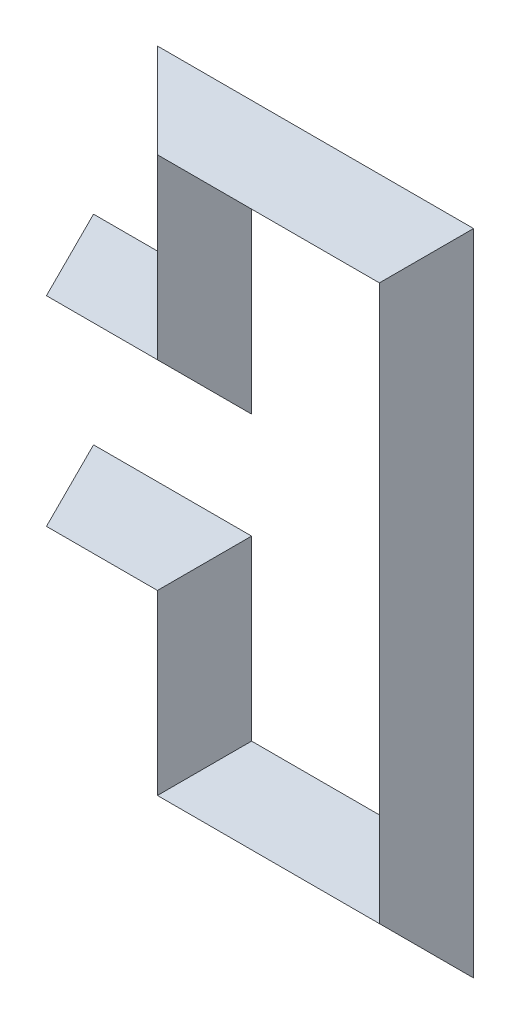
ISO-10303-21;
HEADER;
FILE_DESCRIPTION(('STEP AP214'),'2;1');
FILE_NAME('part.step','',(''),(''),'','','');
FILE_SCHEMA(('AUTOMOTIVE_DESIGN { 1 0 10303 214 1 1 1 1 }'));
ENDSEC;
DATA;
#1=APPLICATION_CONTEXT('core data for automotive mechanical design processes');
#2=APPLICATION_PROTOCOL_DEFINITION('international standard','automotive_design',2000,#1);
#3=PRODUCT_CONTEXT('',#1,'mechanical');
#4=PRODUCT('Part','Part','',(#3));
#5=PRODUCT_RELATED_PRODUCT_CATEGORY('part','',(#4));
#6=PRODUCT_DEFINITION_FORMATION('','',#4);
#7=PRODUCT_DEFINITION_CONTEXT('part definition',#1,'design');
#8=PRODUCT_DEFINITION('design','',#6,#7);
#9=PRODUCT_DEFINITION_SHAPE('','',#8);
#10=(LENGTH_UNIT() NAMED_UNIT(*) SI_UNIT(.MILLI.,.METRE.));
#11=(NAMED_UNIT(*) PLANE_ANGLE_UNIT() SI_UNIT($,.RADIAN.));
#12=(NAMED_UNIT(*) SI_UNIT($,.STERADIAN.) SOLID_ANGLE_UNIT());
#13=UNCERTAINTY_MEASURE_WITH_UNIT(LENGTH_MEASURE(1.E-05),#10,'distance_accuracy_value','');
#14=(GEOMETRIC_REPRESENTATION_CONTEXT(3) GLOBAL_UNCERTAINTY_ASSIGNED_CONTEXT((#13)) GLOBAL_UNIT_ASSIGNED_CONTEXT((#10,
#11,#12)) REPRESENTATION_CONTEXT('',''));
#15=CARTESIAN_POINT('',(0.,0.,0.));
#16=DIRECTION('',(0.,0.,1.));
#17=DIRECTION('',(1.,0.,0.));
#18=AXIS2_PLACEMENT_3D('',#15,#16,#17);
#19=CARTESIAN_POINT('',(90.4003260107554,-49.5996739892445,-19.187122575159));
#20=DIRECTION('',(0.,-0.707106781186547,-0.707106781186548));
#21=DIRECTION('',(0.,0.707106781186548,-0.707106781186547));
#22=AXIS2_PLACEMENT_3D('',#19,#20,#21);
#23=PLANE('',#22);
#24=DIRECTION('',(0.,0.707106781186548,-0.707106781186547));
#25=VECTOR('',#24,1.);
#26=CARTESIAN_POINT('',(0.,-49.5996739892445,-19.187122575159));
#27=LINE('',#26,#25);
#28=CARTESIAN_POINT('',(0.,-90.,21.2132034355963));
#29=VERTEX_POINT('',#28);
#30=CARTESIAN_POINT('',(0.,-68.7867965644036,0.));
#31=VERTEX_POINT('',#30);
#32=EDGE_CURVE('E48',#29,#31,#27,.T.);
#33=ORIENTED_EDGE('',*,*,#32,.F.);
#34=DIRECTION('',(-1.,0.,0.));
#35=VECTOR('',#34,1.);
#36=CARTESIAN_POINT('',(50.,-90.,21.2132034355964));
#37=LINE('',#36,#35);
#38=CARTESIAN_POINT('',(50.,-90.,21.2132034355964));
#39=VERTEX_POINT('',#38);
#40=EDGE_CURVE('E271',#39,#29,#37,.T.);
#41=ORIENTED_EDGE('',*,*,#40,.F.);
#42=DIRECTION('',(-0.577350269189626,-0.577350269189626,0.577350269189626));
#43=VECTOR('',#42,1.);
#44=CARTESIAN_POINT('',(90.4003260107554,-49.5996739892445,-19.187122575159));
#45=LINE('',#44,#43);
#46=CARTESIAN_POINT('',(71.2132034355964,-68.7867965644036,0.));
#47=VERTEX_POINT('',#46);
#48=EDGE_CURVE('E267',#47,#39,#45,.T.);
#49=ORIENTED_EDGE('',*,*,#48,.F.);
#50=DIRECTION('',(-1.,0.,0.));
#51=VECTOR('',#50,1.);
#52=CARTESIAN_POINT('',(71.2132034355964,-68.7867965644036,0.));
#53=LINE('',#52,#51);
#54=EDGE_CURVE('E280',#47,#31,#53,.T.);
#55=ORIENTED_EDGE('',*,*,#54,.T.);
#56=EDGE_LOOP('',(#33,#41,#49,#55));
#57=FACE_BOUND('',#56,.T.);
#58=ADVANCED_FACE('F39',(#57),#23,.F.);
#59=CARTESIAN_POINT('',(89.3527604089976,-50.6472395910023,60.565963844594));
#60=DIRECTION('',(0.,0.707106781186548,-0.707106781186547));
#61=DIRECTION('',(0.,0.707106781186547,0.707106781186548));
#62=AXIS2_PLACEMENT_3D('',#59,#60,#61);
#63=PLANE('',#62);
#64=DIRECTION('',(0.,0.707106781186547,0.707106781186548));
#65=VECTOR('',#64,1.);
#66=CARTESIAN_POINT('',(0.,-50.6472395910023,60.565963844594));
#67=LINE('',#66,#65);
#68=CARTESIAN_POINT('',(0.,-111.213203435596,0.));
#69=VERTEX_POINT('',#68);
#70=EDGE_CURVE('E286',#69,#29,#67,.T.);
#71=ORIENTED_EDGE('',*,*,#70,.F.);
#72=DIRECTION('',(-1.,0.,0.));
#73=VECTOR('',#72,1.);
#74=CARTESIAN_POINT('',(28.7867965644036,-111.213203435596,0.));
#75=LINE('',#74,#73);
#76=CARTESIAN_POINT('',(28.7867965644036,-111.213203435596,0.));
#77=VERTEX_POINT('',#76);
#78=EDGE_CURVE('E274',#77,#69,#75,.T.);
#79=ORIENTED_EDGE('',*,*,#78,.F.);
#80=DIRECTION('',(-0.577350269189626,-0.577350269189626,-0.577350269189626));
#81=VECTOR('',#80,1.);
#82=CARTESIAN_POINT('',(89.3527604089976,-50.6472395910023,60.565963844594));
#83=LINE('',#82,#81);
#84=EDGE_CURVE('E270',#39,#77,#83,.T.);
#85=ORIENTED_EDGE('',*,*,#84,.F.);
#86=ORIENTED_EDGE('',*,*,#40,.T.);
#87=EDGE_LOOP('',(#71,#79,#85,#86));
#88=FACE_BOUND('',#87,.T.);
#89=ADVANCED_FACE('F394',(#88),#63,.F.);
#90=CARTESIAN_POINT('',(89.8765432098765,-50.1234567901235,-61.089746645473));
#91=DIRECTION('',(0.,0.707106781186547,0.707106781186548));
#92=DIRECTION('',(0.,-0.707106781186548,0.707106781186547));
#93=AXIS2_PLACEMENT_3D('',#90,#91,#92);
#94=PLANE('',#93);
#95=DIRECTION('',(0.,-0.707106781186548,0.707106781186547));
#96=VECTOR('',#95,1.);
#97=CARTESIAN_POINT('',(0.,-50.1234567901235,-61.089746645473));
#98=LINE('',#97,#96);
#99=CARTESIAN_POINT('',(0.,-90.,-21.2132034355964));
#100=VERTEX_POINT('',#99);
#101=EDGE_CURVE('E282',#100,#69,#98,.T.);
#102=ORIENTED_EDGE('',*,*,#101,.F.);
#103=DIRECTION('',(-1.,0.,0.));
#104=VECTOR('',#103,1.);
#105=CARTESIAN_POINT('',(50.,-90.,-21.2132034355964));
#106=LINE('',#105,#104);
#107=CARTESIAN_POINT('',(50.,-90.,-21.2132034355964));
#108=VERTEX_POINT('',#107);
#109=EDGE_CURVE('E278',#108,#100,#106,.T.);
#110=ORIENTED_EDGE('',*,*,#109,.F.);
#111=DIRECTION('',(0.577350269189626,0.577350269189626,-0.577350269189626));
#112=VECTOR('',#111,1.);
#113=CARTESIAN_POINT('',(89.8765432098765,-50.1234567901235,-61.089746645473));
#114=LINE('',#113,#112);
#115=EDGE_CURVE('E294',#77,#108,#114,.T.);
#116=ORIENTED_EDGE('',*,*,#115,.F.);
#117=ORIENTED_EDGE('',*,*,#78,.T.);
#118=EDGE_LOOP('',(#102,#110,#116,#117));
#119=FACE_BOUND('',#118,.T.);
#120=ADVANCED_FACE('F396',(#119),#94,.F.);
#121=CARTESIAN_POINT('',(89.8765432098766,-50.1234567901234,18.6633397742801));
#122=DIRECTION('',(0.,-0.707106781186548,0.707106781186547));
#123=DIRECTION('',(0.,-0.707106781186547,-0.707106781186548));
#124=AXIS2_PLACEMENT_3D('',#121,#122,#123);
#125=PLANE('',#124);
#126=DIRECTION('',(0.,-0.707106781186547,-0.707106781186548));
#127=VECTOR('',#126,1.);
#128=CARTESIAN_POINT('',(0.,-50.1234567901234,18.6633397742801));
#129=LINE('',#128,#127);
#130=EDGE_CURVE('E12',#31,#100,#129,.T.);
#131=ORIENTED_EDGE('',*,*,#130,.F.);
#132=ORIENTED_EDGE('',*,*,#54,.F.);
#133=DIRECTION('',(0.577350269189626,0.577350269189626,0.577350269189626));
#134=VECTOR('',#133,1.);
#135=CARTESIAN_POINT('',(89.8765432098766,-50.1234567901234,18.6633397742801));
#136=LINE('',#135,#134);
#137=EDGE_CURVE('E275',#108,#47,#136,.T.);
#138=ORIENTED_EDGE('',*,*,#137,.F.);
#139=ORIENTED_EDGE('',*,*,#109,.T.);
#140=EDGE_LOOP('',(#131,#132,#138,#139));
#141=FACE_BOUND('',#140,.T.);
#142=ADVANCED_FACE('F41',(#141),#125,.F.);
#143=CARTESIAN_POINT('',(116.019427075664,-103.980572924336,87.2326305112607));
#144=DIRECTION('',(-0.707106781186548,0.,0.707106781186547));
#145=DIRECTION('',(0.707106781186547,0.,0.707106781186548));
#146=AXIS2_PLACEMENT_3D('',#143,#144,#145);
#147=PLANE('',#146);
#148=DIRECTION('',(0.,1.,0.));
#149=VECTOR('',#148,1.);
#150=CARTESIAN_POINT('',(50.,-170.,21.2132034355964));
#151=LINE('',#150,#149);
#152=CARTESIAN_POINT('',(50.,-170.,21.2132034355964));
#153=VERTEX_POINT('',#152);
#154=EDGE_CURVE('E264',#153,#39,#151,.T.);
#155=ORIENTED_EDGE('',*,*,#154,.T.);
#156=ORIENTED_EDGE('',*,*,#84,.T.);
#157=DIRECTION('',(0.,1.,0.));
#158=VECTOR('',#157,1.);
#159=CARTESIAN_POINT('',(28.7867965644037,-191.213203435596,-1.38777878078145E-13));
#160=LINE('',#159,#158);
#161=CARTESIAN_POINT('',(28.7867965644037,-191.213203435596,-1.38777878078145E-13));
#162=VERTEX_POINT('',#161);
#163=EDGE_CURVE('E254',#162,#77,#160,.T.);
#164=ORIENTED_EDGE('',*,*,#163,.F.);
#165=DIRECTION('',(0.577350269189626,0.577350269189626,0.577350269189626));
#166=VECTOR('',#165,1.);
#167=CARTESIAN_POINT('',(116.019427075664,-103.980572924336,87.2326305112607));
#168=LINE('',#167,#166);
#169=EDGE_CURVE('E255',#162,#153,#168,.T.);
#170=ORIENTED_EDGE('',*,*,#169,.T.);
#171=EDGE_LOOP('',(#155,#156,#164,#170));
#172=FACE_BOUND('',#171,.T.);
#173=ADVANCED_FACE('F383',(#172),#147,.T.);
#174=CARTESIAN_POINT('',(116.543209876543,-103.456790123457,-87.7564133121396));
#175=DIRECTION('',(-0.707106781186547,0.,-0.707106781186548));
#176=DIRECTION('',(-0.707106781186548,0.,0.707106781186547));
#177=AXIS2_PLACEMENT_3D('',#174,#175,#176);
#178=PLANE('',#177);
#179=ORIENTED_EDGE('',*,*,#163,.T.);
#180=ORIENTED_EDGE('',*,*,#115,.T.);
#181=DIRECTION('',(0.,1.,0.));
#182=VECTOR('',#181,1.);
#183=CARTESIAN_POINT('',(50.,-170.,-21.2132034355964));
#184=LINE('',#183,#182);
#185=CARTESIAN_POINT('',(50.,-170.,-21.2132034355964));
#186=VERTEX_POINT('',#185);
#187=EDGE_CURVE('E258',#186,#108,#184,.T.);
#188=ORIENTED_EDGE('',*,*,#187,.F.);
#189=DIRECTION('',(-0.577350269189626,-0.577350269189626,0.577350269189626));
#190=VECTOR('',#189,1.);
#191=CARTESIAN_POINT('',(116.543209876543,-103.456790123457,-87.7564133121396));
#192=LINE('',#191,#190);
#193=EDGE_CURVE('E301',#186,#162,#192,.T.);
#194=ORIENTED_EDGE('',*,*,#193,.T.);
#195=EDGE_LOOP('',(#179,#180,#188,#194));
#196=FACE_BOUND('',#195,.T.);
#197=ADVANCED_FACE('F386',(#196),#178,.T.);
#198=CARTESIAN_POINT('',(116.543209876543,-103.456790123457,45.3300064409468));
#199=DIRECTION('',(0.707106781186548,0.,-0.707106781186547));
#200=DIRECTION('',(-0.707106781186547,0.,-0.707106781186548));
#201=AXIS2_PLACEMENT_3D('',#198,#199,#200);
#202=PLANE('',#201);
#203=ORIENTED_EDGE('',*,*,#187,.T.);
#204=ORIENTED_EDGE('',*,*,#137,.T.);
#205=DIRECTION('',(0.,1.,0.));
#206=VECTOR('',#205,1.);
#207=CARTESIAN_POINT('',(71.2132034355964,-148.786796564404,0.));
#208=LINE('',#207,#206);
#209=CARTESIAN_POINT('',(71.2132034355964,-148.786796564404,0.));
#210=VERTEX_POINT('',#209);
#211=EDGE_CURVE('E261',#210,#47,#208,.T.);
#212=ORIENTED_EDGE('',*,*,#211,.F.);
#213=DIRECTION('',(-0.577350269189626,-0.577350269189626,-0.577350269189626));
#214=VECTOR('',#213,1.);
#215=CARTESIAN_POINT('',(116.543209876543,-103.456790123457,45.3300064409468));
#216=LINE('',#215,#214);
#217=EDGE_CURVE('E250',#210,#186,#216,.T.);
#218=ORIENTED_EDGE('',*,*,#217,.T.);
#219=EDGE_LOOP('',(#203,#204,#212,#218));
#220=FACE_BOUND('',#219,.T.);
#221=ADVANCED_FACE('F389',(#220),#202,.T.);
#222=CARTESIAN_POINT('',(117.066992677422,-102.933007322578,-45.8537892418257));
#223=DIRECTION('',(0.707106781186547,0.,0.707106781186548));
#224=DIRECTION('',(0.707106781186548,0.,-0.707106781186547));
#225=AXIS2_PLACEMENT_3D('',#222,#223,#224);
#226=PLANE('',#225);
#227=ORIENTED_EDGE('',*,*,#211,.T.);
#228=ORIENTED_EDGE('',*,*,#48,.T.);
#229=ORIENTED_EDGE('',*,*,#154,.F.);
#230=DIRECTION('',(0.577350269189626,0.577350269189626,-0.577350269189626));
#231=VECTOR('',#230,1.);
#232=CARTESIAN_POINT('',(117.066992677422,-102.933007322578,-45.8537892418257));
#233=LINE('',#232,#231);
#234=EDGE_CURVE('E251',#153,#210,#233,.T.);
#235=ORIENTED_EDGE('',*,*,#234,.T.);
#236=EDGE_LOOP('',(#227,#228,#229,#235));
#237=FACE_BOUND('',#236,.T.);
#238=ADVANCED_FACE('F392',(#237),#226,.T.);
#239=CARTESIAN_POINT('',(51.9417187730072,-71.9417187730072,119.271484662589));
#240=DIRECTION('',(0.,0.707106781186548,-0.707106781186547));
#241=DIRECTION('',(0.,0.707106781186547,0.707106781186548));
#242=AXIS2_PLACEMENT_3D('',#239,#240,#241);
#243=PLANE('',#242);
#244=ORIENTED_EDGE('',*,*,#169,.F.);
#245=DIRECTION('',(-1.,0.,0.));
#246=VECTOR('',#245,1.);
#247=CARTESIAN_POINT('',(171.213203435596,-191.213203435596,0.));
#248=LINE('',#247,#246);
#249=CARTESIAN_POINT('',(171.213203435596,-191.213203435596,0.));
#250=VERTEX_POINT('',#249);
#251=EDGE_CURVE('E237',#250,#162,#248,.T.);
#252=ORIENTED_EDGE('',*,*,#251,.F.);
#253=DIRECTION('',(0.577350269189626,-0.577350269189626,-0.577350269189626));
#254=VECTOR('',#253,1.);
#255=CARTESIAN_POINT('',(51.9417187730072,-71.9417187730072,119.271484662589));
#256=LINE('',#255,#254);
#257=CARTESIAN_POINT('',(150.,-170.,21.2132034355964));
#258=VERTEX_POINT('',#257);
#259=EDGE_CURVE('E233',#258,#250,#256,.T.);
#260=ORIENTED_EDGE('',*,*,#259,.F.);
#261=DIRECTION('',(-1.,0.,0.));
#262=VECTOR('',#261,1.);
#263=CARTESIAN_POINT('',(150.,-170.,21.2132034355964));
#264=LINE('',#263,#262);
#265=EDGE_CURVE('E247',#258,#153,#264,.T.);
#266=ORIENTED_EDGE('',*,*,#265,.T.);
#267=EDGE_LOOP('',(#244,#252,#260,#266));
#268=FACE_BOUND('',#267,.T.);
#269=ADVANCED_FACE('F381',(#268),#243,.F.);
#270=CARTESIAN_POINT('',(50.3703703703704,-70.3703703703704,-120.842833065226));
#271=DIRECTION('',(0.,0.707106781186547,0.707106781186548));
#272=DIRECTION('',(0.,-0.707106781186548,0.707106781186547));
#273=AXIS2_PLACEMENT_3D('',#270,#271,#272);
#274=PLANE('',#273);
#275=ORIENTED_EDGE('',*,*,#193,.F.);
#276=DIRECTION('',(-1.,0.,0.));
#277=VECTOR('',#276,1.);
#278=CARTESIAN_POINT('',(150.,-170.,-21.2132034355964));
#279=LINE('',#278,#277);
#280=CARTESIAN_POINT('',(150.,-170.,-21.2132034355964));
#281=VERTEX_POINT('',#280);
#282=EDGE_CURVE('E240',#281,#186,#279,.T.);
#283=ORIENTED_EDGE('',*,*,#282,.F.);
#284=DIRECTION('',(-0.577350269189626,0.577350269189626,-0.577350269189626));
#285=VECTOR('',#284,1.);
#286=CARTESIAN_POINT('',(50.3703703703704,-70.3703703703704,-120.842833065226));
#287=LINE('',#286,#285);
#288=EDGE_CURVE('E236',#250,#281,#287,.T.);
#289=ORIENTED_EDGE('',*,*,#288,.F.);
#290=ORIENTED_EDGE('',*,*,#251,.T.);
#291=EDGE_LOOP('',(#275,#283,#289,#290));
#292=FACE_BOUND('',#291,.T.);
#293=ADVANCED_FACE('F369',(#292),#274,.F.);
#294=CARTESIAN_POINT('',(50.3703703703704,-70.3703703703704,78.4164261940332));
#295=DIRECTION('',(0.,-0.707106781186548,0.707106781186547));
#296=DIRECTION('',(0.,-0.707106781186547,-0.707106781186548));
#297=AXIS2_PLACEMENT_3D('',#294,#295,#296);
#298=PLANE('',#297);
#299=ORIENTED_EDGE('',*,*,#217,.F.);
#300=DIRECTION('',(-1.,0.,0.));
#301=VECTOR('',#300,1.);
#302=CARTESIAN_POINT('',(128.786796564404,-148.786796564404,0.));
#303=LINE('',#302,#301);
#304=CARTESIAN_POINT('',(128.786796564404,-148.786796564404,0.));
#305=VERTEX_POINT('',#304);
#306=EDGE_CURVE('E244',#305,#210,#303,.T.);
#307=ORIENTED_EDGE('',*,*,#306,.F.);
#308=DIRECTION('',(-0.577350269189626,0.577350269189626,0.577350269189626));
#309=VECTOR('',#308,1.);
#310=CARTESIAN_POINT('',(50.3703703703704,-70.3703703703704,78.4164261940332));
#311=LINE('',#310,#309);
#312=EDGE_CURVE('E308',#281,#305,#311,.T.);
#313=ORIENTED_EDGE('',*,*,#312,.F.);
#314=ORIENTED_EDGE('',*,*,#282,.T.);
#315=EDGE_LOOP('',(#299,#307,#313,#314));
#316=FACE_BOUND('',#315,.T.);
#317=ADVANCED_FACE('F373',(#316),#298,.F.);
#318=CARTESIAN_POINT('',(48.7990219677336,-68.7990219677336,-79.98777459667));
#319=DIRECTION('',(0.,-0.707106781186547,-0.707106781186548));
#320=DIRECTION('',(0.,0.707106781186548,-0.707106781186547));
#321=AXIS2_PLACEMENT_3D('',#318,#319,#320);
#322=PLANE('',#321);
#323=ORIENTED_EDGE('',*,*,#234,.F.);
#324=ORIENTED_EDGE('',*,*,#265,.F.);
#325=DIRECTION('',(0.577350269189626,-0.577350269189626,0.577350269189626));
#326=VECTOR('',#325,1.);
#327=CARTESIAN_POINT('',(48.7990219677336,-68.7990219677336,-79.98777459667));
#328=LINE('',#327,#326);
#329=EDGE_CURVE('E241',#305,#258,#328,.T.);
#330=ORIENTED_EDGE('',*,*,#329,.F.);
#331=ORIENTED_EDGE('',*,*,#306,.T.);
#332=EDGE_LOOP('',(#323,#324,#330,#331));
#333=FACE_BOUND('',#332,.T.);
#334=ADVANCED_FACE('F377',(#333),#322,.F.);
#335=CARTESIAN_POINT('',(101.111111111111,31.1111111111111,-70.1020923244853));
#336=DIRECTION('',(0.707106781186547,0.,-0.707106781186548));
#337=DIRECTION('',(-0.707106781186548,0.,-0.707106781186547));
#338=AXIS2_PLACEMENT_3D('',#335,#336,#337);
#339=PLANE('',#338);
#340=DIRECTION('',(0.,-1.,0.));
#341=VECTOR('',#340,1.);
#342=CARTESIAN_POINT('',(171.213203435596,101.213203435596,0.));
#343=LINE('',#342,#341);
#344=CARTESIAN_POINT('',(171.213203435596,101.213203435596,0.));
#345=VERTEX_POINT('',#344);
#346=EDGE_CURVE('E230',#345,#250,#343,.T.);
#347=ORIENTED_EDGE('',*,*,#346,.T.);
#348=ORIENTED_EDGE('',*,*,#288,.T.);
#349=DIRECTION('',(0.,-1.,0.));
#350=VECTOR('',#349,1.);
#351=CARTESIAN_POINT('',(150.,80.,-21.2132034355964));
#352=LINE('',#351,#350);
#353=CARTESIAN_POINT('',(150.,80.,-21.2132034355964));
#354=VERTEX_POINT('',#353);
#355=EDGE_CURVE('E220',#354,#281,#352,.T.);
#356=ORIENTED_EDGE('',*,*,#355,.F.);
#357=DIRECTION('',(0.577350269189626,0.577350269189626,0.577350269189626));
#358=VECTOR('',#357,1.);
#359=CARTESIAN_POINT('',(101.111111111111,31.1111111111111,-70.1020923244853));
#360=LINE('',#359,#358);
#361=EDGE_CURVE('E221',#354,#345,#360,.T.);
#362=ORIENTED_EDGE('',*,*,#361,.T.);
#363=EDGE_LOOP('',(#347,#348,#356,#362));
#364=FACE_BOUND('',#363,.T.);
#365=ADVANCED_FACE('F365',(#364),#339,.T.);
#366=CARTESIAN_POINT('',(101.111111111111,31.1111111111111,27.6756854532924));
#367=DIRECTION('',(-0.707106781186548,0.,-0.707106781186547));
#368=DIRECTION('',(-0.707106781186547,0.,0.707106781186548));
#369=AXIS2_PLACEMENT_3D('',#366,#367,#368);
#370=PLANE('',#369);
#371=ORIENTED_EDGE('',*,*,#355,.T.);
#372=ORIENTED_EDGE('',*,*,#312,.T.);
#373=DIRECTION('',(0.,-1.,0.));
#374=VECTOR('',#373,1.);
#375=CARTESIAN_POINT('',(128.786796564404,58.7867965644036,0.));
#376=LINE('',#375,#374);
#377=CARTESIAN_POINT('',(128.786796564404,58.7867965644036,0.));
#378=VERTEX_POINT('',#377);
#379=EDGE_CURVE('E224',#378,#305,#376,.T.);
#380=ORIENTED_EDGE('',*,*,#379,.F.);
#381=DIRECTION('',(0.577350269189626,0.577350269189626,-0.577350269189626));
#382=VECTOR('',#381,1.);
#383=CARTESIAN_POINT('',(101.111111111111,31.1111111111111,27.6756854532924));
#384=LINE('',#383,#382);
#385=EDGE_CURVE('E315',#378,#354,#384,.T.);
#386=ORIENTED_EDGE('',*,*,#385,.T.);
#387=EDGE_LOOP('',(#371,#372,#380,#386));
#388=FACE_BOUND('',#387,.T.);
#389=ADVANCED_FACE('F363',(#388),#370,.T.);
#390=CARTESIAN_POINT('',(96.3970659032008,26.3970659032008,-32.3897306612028));
#391=DIRECTION('',(-0.707106781186547,0.,0.707106781186548));
#392=DIRECTION('',(0.707106781186548,0.,0.707106781186547));
#393=AXIS2_PLACEMENT_3D('',#390,#391,#392);
#394=PLANE('',#393);
#395=ORIENTED_EDGE('',*,*,#379,.T.);
#396=ORIENTED_EDGE('',*,*,#329,.T.);
#397=DIRECTION('',(0.,-1.,0.));
#398=VECTOR('',#397,1.);
#399=CARTESIAN_POINT('',(150.,80.,21.2132034355964));
#400=LINE('',#399,#398);
#401=CARTESIAN_POINT('',(150.,80.,21.2132034355964));
#402=VERTEX_POINT('',#401);
#403=EDGE_CURVE('E227',#402,#258,#400,.T.);
#404=ORIENTED_EDGE('',*,*,#403,.F.);
#405=DIRECTION('',(-0.577350269189626,-0.577350269189626,-0.577350269189626));
#406=VECTOR('',#405,1.);
#407=CARTESIAN_POINT('',(96.3970659032008,26.3970659032008,-32.3897306612028));
#408=LINE('',#407,#406);
#409=EDGE_CURVE('E216',#402,#378,#408,.T.);
#410=ORIENTED_EDGE('',*,*,#409,.T.);
#411=EDGE_LOOP('',(#395,#396,#404,#410));
#412=FACE_BOUND('',#411,.T.);
#413=ADVANCED_FACE('F359',(#412),#394,.T.);
#414=CARTESIAN_POINT('',(105.825156319021,35.8251563190214,65.388047116575));
#415=DIRECTION('',(0.707106781186548,0.,0.707106781186547));
#416=DIRECTION('',(0.707106781186547,0.,-0.707106781186548));
#417=AXIS2_PLACEMENT_3D('',#414,#415,#416);
#418=PLANE('',#417);
#419=ORIENTED_EDGE('',*,*,#403,.T.);
#420=ORIENTED_EDGE('',*,*,#259,.T.);
#421=ORIENTED_EDGE('',*,*,#346,.F.);
#422=DIRECTION('',(-0.577350269189626,-0.577350269189626,0.577350269189626));
#423=VECTOR('',#422,1.);
#424=CARTESIAN_POINT('',(105.825156319021,35.8251563190214,65.388047116575));
#425=LINE('',#424,#423);
#426=EDGE_CURVE('E217',#345,#402,#425,.T.);
#427=ORIENTED_EDGE('',*,*,#426,.T.);
#428=EDGE_LOOP('',(#419,#420,#421,#427));
#429=FACE_BOUND('',#428,.T.);
#430=ADVANCED_FACE('F353',(#429),#418,.T.);
#431=CARTESIAN_POINT('',(96.6666666666667,33.3333333333333,-67.8798701022631));
#432=DIRECTION('',(0.,-0.707106781186547,0.707106781186548));
#433=DIRECTION('',(0.,-0.707106781186548,-0.707106781186547));
#434=AXIS2_PLACEMENT_3D('',#431,#432,#433);
#435=PLANE('',#434);
#436=ORIENTED_EDGE('',*,*,#361,.F.);
#437=DIRECTION('',(1.,0.,0.));
#438=VECTOR('',#437,1.);
#439=CARTESIAN_POINT('',(50.,80.,-21.2132034355964));
#440=LINE('',#439,#438);
#441=CARTESIAN_POINT('',(50.,80.,-21.2132034355964));
#442=VERTEX_POINT('',#441);
#443=EDGE_CURVE('E203',#442,#354,#440,.T.);
#444=ORIENTED_EDGE('',*,*,#443,.F.);
#445=DIRECTION('',(0.577350269189626,-0.577350269189626,-0.577350269189626));
#446=VECTOR('',#445,1.);
#447=CARTESIAN_POINT('',(96.6666666666667,33.3333333333333,-67.8798701022631));
#448=LINE('',#447,#446);
#449=CARTESIAN_POINT('',(28.7867965644036,101.213203435596,0.));
#450=VERTEX_POINT('',#449);
#451=EDGE_CURVE('E199',#450,#442,#448,.T.);
#452=ORIENTED_EDGE('',*,*,#451,.F.);
#453=DIRECTION('',(1.,0.,0.));
#454=VECTOR('',#453,1.);
#455=CARTESIAN_POINT('',(28.7867965644036,101.213203435596,0.));
#456=LINE('',#455,#454);
#457=EDGE_CURVE('E213',#450,#345,#456,.T.);
#458=ORIENTED_EDGE('',*,*,#457,.T.);
#459=EDGE_LOOP('',(#436,#444,#452,#458));
#460=FACE_BOUND('',#459,.T.);
#461=ADVANCED_FACE('F343',(#460),#435,.F.);
#462=CARTESIAN_POINT('',(96.6666666666667,33.3333333333333,25.4534632310702));
#463=DIRECTION('',(0.,0.707106781186548,0.707106781186547));
#464=DIRECTION('',(0.,-0.707106781186547,0.707106781186548));
#465=AXIS2_PLACEMENT_3D('',#462,#463,#464);
#466=PLANE('',#465);
#467=ORIENTED_EDGE('',*,*,#385,.F.);
#468=DIRECTION('',(1.,0.,0.));
#469=VECTOR('',#468,1.);
#470=CARTESIAN_POINT('',(71.2132034355965,58.7867965644036,0.));
#471=LINE('',#470,#469);
#472=CARTESIAN_POINT('',(71.2132034355965,58.7867965644036,0.));
#473=VERTEX_POINT('',#472);
#474=EDGE_CURVE('E206',#473,#378,#471,.T.);
#475=ORIENTED_EDGE('',*,*,#474,.F.);
#476=DIRECTION('',(0.577350269189626,-0.577350269189626,0.577350269189626));
#477=VECTOR('',#476,1.);
#478=CARTESIAN_POINT('',(96.6666666666667,33.3333333333333,25.4534632310702));
#479=LINE('',#478,#477);
#480=EDGE_CURVE('E202',#442,#473,#479,.T.);
#481=ORIENTED_EDGE('',*,*,#480,.F.);
#482=ORIENTED_EDGE('',*,*,#443,.T.);
#483=EDGE_LOOP('',(#467,#475,#481,#482));
#484=FACE_BOUND('',#483,.T.);
#485=ADVANCED_FACE('F361',(#484),#466,.F.);
#486=CARTESIAN_POINT('',(110.808802290398,19.1911977096024,-39.5955988548012));
#487=DIRECTION('',(0.,0.707106781186547,-0.707106781186548));
#488=DIRECTION('',(0.,0.707106781186548,0.707106781186547));
#489=AXIS2_PLACEMENT_3D('',#486,#487,#488);
#490=PLANE('',#489);
#491=ORIENTED_EDGE('',*,*,#409,.F.);
#492=DIRECTION('',(1.,0.,0.));
#493=VECTOR('',#492,1.);
#494=CARTESIAN_POINT('',(50.,80.,21.2132034355964));
#495=LINE('',#494,#493);
#496=CARTESIAN_POINT('',(50.,80.,21.2132034355964));
#497=VERTEX_POINT('',#496);
#498=EDGE_CURVE('E210',#497,#402,#495,.T.);
#499=ORIENTED_EDGE('',*,*,#498,.F.);
#500=DIRECTION('',(-0.577350269189626,0.577350269189626,0.577350269189626));
#501=VECTOR('',#500,1.);
#502=CARTESIAN_POINT('',(110.808802290398,19.1911977096024,-39.5955988548012));
#503=LINE('',#502,#501);
#504=EDGE_CURVE('E322',#473,#497,#503,.T.);
#505=ORIENTED_EDGE('',*,*,#504,.F.);
#506=ORIENTED_EDGE('',*,*,#474,.T.);
#507=EDGE_LOOP('',(#491,#499,#505,#506));
#508=FACE_BOUND('',#507,.T.);
#509=ADVANCED_FACE('F355',(#508),#490,.F.);
#510=CARTESIAN_POINT('',(82.5245310429357,47.4754689570643,53.7377344785321));
#511=DIRECTION('',(0.,-0.707106781186548,-0.707106781186547));
#512=DIRECTION('',(0.,0.707106781186547,-0.707106781186548));
#513=AXIS2_PLACEMENT_3D('',#510,#511,#512);
#514=PLANE('',#513);
#515=ORIENTED_EDGE('',*,*,#426,.F.);
#516=ORIENTED_EDGE('',*,*,#457,.F.);
#517=DIRECTION('',(-0.577350269189626,0.577350269189626,-0.577350269189626));
#518=VECTOR('',#517,1.);
#519=CARTESIAN_POINT('',(82.5245310429357,47.4754689570643,53.7377344785321));
#520=LINE('',#519,#518);
#521=EDGE_CURVE('E207',#497,#450,#520,.T.);
#522=ORIENTED_EDGE('',*,*,#521,.F.);
#523=ORIENTED_EDGE('',*,*,#498,.T.);
#524=EDGE_LOOP('',(#515,#516,#522,#523));
#525=FACE_BOUND('',#524,.T.);
#526=ADVANCED_FACE('F350',(#525),#514,.F.);
#527=CARTESIAN_POINT('',(70.,-20.,-1.21320343559643));
#528=DIRECTION('',(0.707106781186548,0.,-0.707106781186547));
#529=DIRECTION('',(-0.707106781186547,0.,-0.707106781186548));
#530=AXIS2_PLACEMENT_3D('',#527,#528,#529);
#531=PLANE('',#530);
#532=DIRECTION('',(0.,1.,0.));
#533=VECTOR('',#532,1.);
#534=CARTESIAN_POINT('',(50.,0.,-21.2132034355964));
#535=LINE('',#534,#533);
#536=CARTESIAN_POINT('',(50.,0.,-21.2132034355964));
#537=VERTEX_POINT('',#536);
#538=EDGE_CURVE('E196',#537,#442,#535,.T.);
#539=ORIENTED_EDGE('',*,*,#538,.T.);
#540=ORIENTED_EDGE('',*,*,#480,.T.);
#541=DIRECTION('',(0.,1.,0.));
#542=VECTOR('',#541,1.);
#543=CARTESIAN_POINT('',(71.2132034355964,-21.2132034355964,0.));
#544=LINE('',#543,#542);
#545=CARTESIAN_POINT('',(71.2132034355964,-21.2132034355964,0.));
#546=VERTEX_POINT('',#545);
#547=EDGE_CURVE('E187',#546,#473,#544,.T.);
#548=ORIENTED_EDGE('',*,*,#547,.F.);
#549=DIRECTION('',(-0.577350269189626,0.577350269189626,-0.577350269189626));
#550=VECTOR('',#549,1.);
#551=CARTESIAN_POINT('',(70.,-20.,-1.21320343559643));
#552=LINE('',#551,#550);
#553=EDGE_CURVE('E174',#546,#537,#552,.T.);
#554=ORIENTED_EDGE('',*,*,#553,.T.);
#555=EDGE_LOOP('',(#539,#540,#548,#554));
#556=FACE_BOUND('',#555,.T.);
#557=ADVANCED_FACE('F334',(#556),#531,.T.);
#558=CARTESIAN_POINT('',(84.142135623731,-34.1421356237309,-12.9289321881345));
#559=DIRECTION('',(0.707106781186547,0.,0.707106781186548));
#560=DIRECTION('',(0.707106781186548,0.,-0.707106781186547));
#561=AXIS2_PLACEMENT_3D('',#558,#559,#560);
#562=PLANE('',#561);
#563=ORIENTED_EDGE('',*,*,#547,.T.);
#564=ORIENTED_EDGE('',*,*,#504,.T.);
#565=DIRECTION('',(0.,1.,0.));
#566=VECTOR('',#565,1.);
#567=CARTESIAN_POINT('',(50.,0.,21.2132034355964));
#568=LINE('',#567,#566);
#569=CARTESIAN_POINT('',(50.,0.,21.2132034355964));
#570=VERTEX_POINT('',#569);
#571=EDGE_CURVE('E190',#570,#497,#568,.T.);
#572=ORIENTED_EDGE('',*,*,#571,.F.);
#573=DIRECTION('',(0.577350269189626,-0.577350269189626,-0.577350269189626));
#574=VECTOR('',#573,1.);
#575=CARTESIAN_POINT('',(84.142135623731,-34.1421356237309,-12.9289321881345));
#576=LINE('',#575,#574);
#577=EDGE_CURVE('E327',#570,#546,#576,.T.);
#578=ORIENTED_EDGE('',*,*,#577,.T.);
#579=EDGE_LOOP('',(#563,#564,#572,#578));
#580=FACE_BOUND('',#579,.T.);
#581=ADVANCED_FACE('F445',(#580),#562,.T.);
#582=CARTESIAN_POINT('',(55.857864376269,-5.85786437626904,27.0710678118655));
#583=DIRECTION('',(-0.707106781186548,0.,0.707106781186547));
#584=DIRECTION('',(0.707106781186547,0.,0.707106781186548));
#585=AXIS2_PLACEMENT_3D('',#582,#583,#584);
#586=PLANE('',#585);
#587=ORIENTED_EDGE('',*,*,#571,.T.);
#588=ORIENTED_EDGE('',*,*,#521,.T.);
#589=DIRECTION('',(0.,1.,0.));
#590=VECTOR('',#589,1.);
#591=CARTESIAN_POINT('',(28.7867965644036,21.2132034355964,0.));
#592=LINE('',#591,#590);
#593=CARTESIAN_POINT('',(28.7867965644036,21.2132034355964,0.));
#594=VERTEX_POINT('',#593);
#595=EDGE_CURVE('E193',#594,#450,#592,.T.);
#596=ORIENTED_EDGE('',*,*,#595,.F.);
#597=DIRECTION('',(0.577350269189626,-0.577350269189626,0.577350269189626));
#598=VECTOR('',#597,1.);
#599=CARTESIAN_POINT('',(55.857864376269,-5.85786437626904,27.0710678118655));
#600=LINE('',#599,#598);
#601=EDGE_CURVE('E154',#594,#570,#600,.T.);
#602=ORIENTED_EDGE('',*,*,#601,.T.);
#603=EDGE_LOOP('',(#587,#588,#596,#602));
#604=FACE_BOUND('',#603,.T.);
#605=ADVANCED_FACE('F348',(#604),#586,.T.);
#606=CARTESIAN_POINT('',(70.,-20.,-41.2132034355964));
#607=DIRECTION('',(-0.707106781186547,0.,-0.707106781186548));
#608=DIRECTION('',(-0.707106781186548,0.,0.707106781186547));
#609=AXIS2_PLACEMENT_3D('',#606,#607,#608);
#610=PLANE('',#609);
#611=ORIENTED_EDGE('',*,*,#595,.T.);
#612=ORIENTED_EDGE('',*,*,#451,.T.);
#613=ORIENTED_EDGE('',*,*,#538,.F.);
#614=DIRECTION('',(-0.577350269189626,0.577350269189626,0.577350269189626));
#615=VECTOR('',#614,1.);
#616=CARTESIAN_POINT('',(70.,-20.,-41.2132034355964));
#617=LINE('',#616,#615);
#618=EDGE_CURVE('E184',#537,#594,#617,.T.);
#619=ORIENTED_EDGE('',*,*,#618,.T.);
#620=EDGE_LOOP('',(#611,#612,#613,#619));
#621=FACE_BOUND('',#620,.T.);
#622=ADVANCED_FACE('F339',(#621),#610,.T.);
#623=CARTESIAN_POINT('',(110.,0.,-21.2132034355964));
#624=DIRECTION('',(0.,0.707106781186548,0.707106781186547));
#625=DIRECTION('',(0.,-0.707106781186547,0.707106781186548));
#626=AXIS2_PLACEMENT_3D('',#623,#624,#625);
#627=PLANE('',#626);
#628=ORIENTED_EDGE('',*,*,#553,.F.);
#629=DIRECTION('',(-1.,0.,0.));
#630=VECTOR('',#629,1.);
#631=CARTESIAN_POINT('',(110.,-21.2132034355964,0.));
#632=LINE('',#631,#630);
#633=CARTESIAN_POINT('',(0.,-21.2132034355964,0.));
#634=VERTEX_POINT('',#633);
#635=EDGE_CURVE('E181',#546,#634,#632,.T.);
#636=ORIENTED_EDGE('',*,*,#635,.T.);
#637=DIRECTION('',(0.,0.707106781186547,-0.707106781186547));
#638=VECTOR('',#637,1.);
#639=CARTESIAN_POINT('',(0.,0.,-21.2132034355964));
#640=LINE('',#639,#638);
#641=CARTESIAN_POINT('',(0.,0.,-21.2132034355964));
#642=VERTEX_POINT('',#641);
#643=EDGE_CURVE('E178',#634,#642,#640,.T.);
#644=ORIENTED_EDGE('',*,*,#643,.T.);
#645=DIRECTION('',(-1.,0.,0.));
#646=VECTOR('',#645,1.);
#647=CARTESIAN_POINT('',(110.,0.,-21.2132034355964));
#648=LINE('',#647,#646);
#649=EDGE_CURVE('E170',#537,#642,#648,.T.);
#650=ORIENTED_EDGE('',*,*,#649,.F.);
#651=EDGE_LOOP('',(#628,#636,#644,#650));
#652=FACE_BOUND('',#651,.T.);
#653=ADVANCED_FACE('F337',(#652),#627,.F.);
#654=CARTESIAN_POINT('',(110.,-21.2132034355964,0.));
#655=DIRECTION('',(0.,0.707106781186547,-0.707106781186548));
#656=DIRECTION('',(0.,0.707106781186548,0.707106781186547));
#657=AXIS2_PLACEMENT_3D('',#654,#655,#656);
#658=PLANE('',#657);
#659=ORIENTED_EDGE('',*,*,#577,.F.);
#660=DIRECTION('',(-1.,0.,0.));
#661=VECTOR('',#660,1.);
#662=CARTESIAN_POINT('',(110.,0.,21.2132034355964));
#663=LINE('',#662,#661);
#664=CARTESIAN_POINT('',(0.,0.,21.2132034355964));
#665=VERTEX_POINT('',#664);
#666=EDGE_CURVE('E158',#570,#665,#663,.T.);
#667=ORIENTED_EDGE('',*,*,#666,.T.);
#668=DIRECTION('',(0.,-0.707106781186548,-0.707106781186547));
#669=VECTOR('',#668,1.);
#670=CARTESIAN_POINT('',(0.,-21.2132034355964,0.));
#671=LINE('',#670,#669);
#672=EDGE_CURVE('E166',#665,#634,#671,.T.);
#673=ORIENTED_EDGE('',*,*,#672,.T.);
#674=ORIENTED_EDGE('',*,*,#635,.F.);
#675=EDGE_LOOP('',(#659,#667,#673,#674));
#676=FACE_BOUND('',#675,.T.);
#677=ADVANCED_FACE('F454',(#676),#658,.F.);
#678=CARTESIAN_POINT('',(110.,21.2132034355964,0.));
#679=DIRECTION('',(0.,-0.707106781186548,-0.707106781186547));
#680=DIRECTION('',(0.,0.707106781186547,-0.707106781186548));
#681=AXIS2_PLACEMENT_3D('',#678,#679,#680);
#682=PLANE('',#681);
#683=ORIENTED_EDGE('',*,*,#601,.F.);
#684=DIRECTION('',(-1.,0.,0.));
#685=VECTOR('',#684,1.);
#686=CARTESIAN_POINT('',(110.,21.2132034355964,0.));
#687=LINE('',#686,#685);
#688=CARTESIAN_POINT('',(0.,21.2132034355964,0.));
#689=VERTEX_POINT('',#688);
#690=EDGE_CURVE('E147',#594,#689,#687,.T.);
#691=ORIENTED_EDGE('',*,*,#690,.T.);
#692=DIRECTION('',(0.,-0.707106781186547,0.707106781186547));
#693=VECTOR('',#692,1.);
#694=CARTESIAN_POINT('',(0.,21.2132034355964,0.));
#695=LINE('',#694,#693);
#696=EDGE_CURVE('E151',#689,#665,#695,.T.);
#697=ORIENTED_EDGE('',*,*,#696,.T.);
#698=ORIENTED_EDGE('',*,*,#666,.F.);
#699=EDGE_LOOP('',(#683,#691,#697,#698));
#700=FACE_BOUND('',#699,.T.);
#701=ADVANCED_FACE('F149',(#700),#682,.F.);
#702=CARTESIAN_POINT('',(110.,0.,-21.2132034355964));
#703=DIRECTION('',(0.,-0.707106781186547,0.707106781186548));
#704=DIRECTION('',(0.,-0.707106781186548,-0.707106781186547));
#705=AXIS2_PLACEMENT_3D('',#702,#703,#704);
#706=PLANE('',#705);
#707=ORIENTED_EDGE('',*,*,#618,.F.);
#708=ORIENTED_EDGE('',*,*,#649,.T.);
#709=DIRECTION('',(0.,0.707106781186548,0.707106781186547));
#710=VECTOR('',#709,1.);
#711=CARTESIAN_POINT('',(0.,0.,-21.2132034355964));
#712=LINE('',#711,#710);
#713=EDGE_CURVE('E164',#642,#689,#712,.T.);
#714=ORIENTED_EDGE('',*,*,#713,.T.);
#715=ORIENTED_EDGE('',*,*,#690,.F.);
#716=EDGE_LOOP('',(#707,#708,#714,#715));
#717=FACE_BOUND('',#716,.T.);
#718=ADVANCED_FACE('F168',(#717),#706,.F.);
#719=CARTESIAN_POINT('',(0.,0.,0.));
#720=DIRECTION('',(1.,0.,0.));
#721=DIRECTION('',(0.,0.,-1.));
#722=AXIS2_PLACEMENT_3D('',#719,#720,#721);
#723=PLANE('',#722);
#724=ORIENTED_EDGE('',*,*,#713,.F.);
#725=ORIENTED_EDGE('',*,*,#643,.F.);
#726=ORIENTED_EDGE('',*,*,#672,.F.);
#727=ORIENTED_EDGE('',*,*,#696,.F.);
#728=EDGE_LOOP('',(#724,#725,#726,#727));
#729=FACE_BOUND('',#728,.T.);
#730=ADVANCED_FACE('F162',(#729),#723,.F.);
#731=CARTESIAN_POINT('',(0.,-90.,0.));
#732=DIRECTION('',(-1.,0.,0.));
#733=DIRECTION('',(0.,0.,1.));
#734=AXIS2_PLACEMENT_3D('',#731,#732,#733);
#735=PLANE('',#734);
#736=ORIENTED_EDGE('',*,*,#32,.T.);
#737=ORIENTED_EDGE('',*,*,#130,.T.);
#738=ORIENTED_EDGE('',*,*,#101,.T.);
#739=ORIENTED_EDGE('',*,*,#70,.T.);
#740=EDGE_LOOP('',(#736,#737,#738,#739));
#741=FACE_BOUND('',#740,.T.);
#742=ADVANCED_FACE('F462',(#741),#735,.T.);
#743=CLOSED_SHELL('',(#58,#89,#120,#142,#173,#197,#221,#238,#269,#293,#317,#334,#365,#389,#413,
#430,#461,#485,#509,#526,#557,#581,#605,#622,#653,#677,#701,#718,#730,#742));
#744=MANIFOLD_SOLID_BREP('B2',#743);
#745=ADVANCED_BREP_SHAPE_REPRESENTATION('',(#18,#744),#14);
#746=SHAPE_DEFINITION_REPRESENTATION(#9,#745);
ENDSEC;
END-ISO-10303-21;
